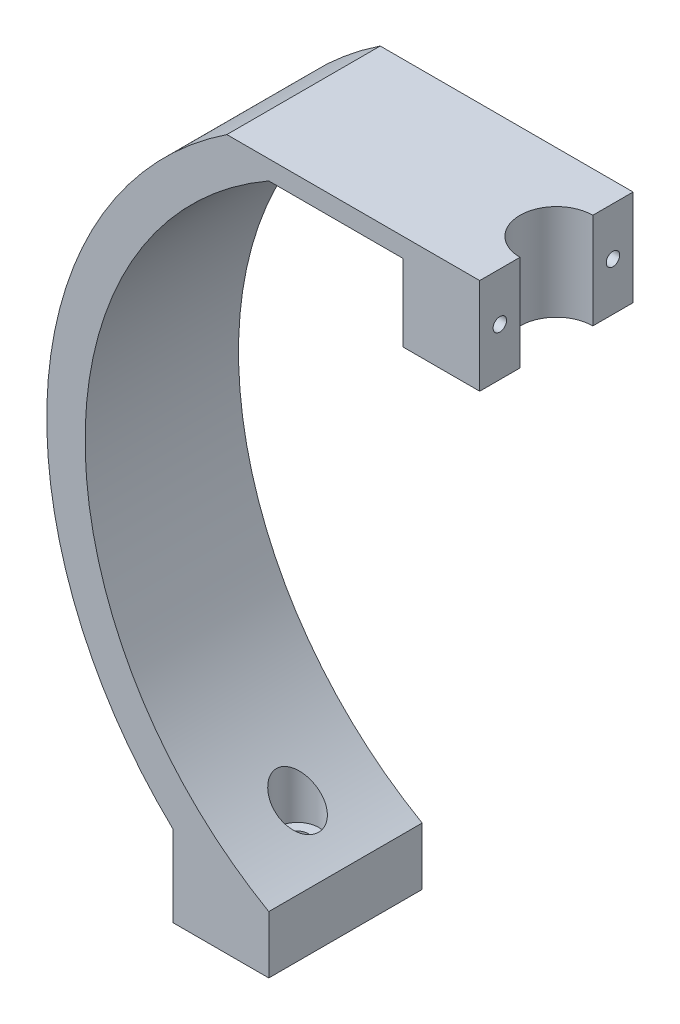
ISO-10303-21;
HEADER;
FILE_DESCRIPTION(('STEP AP214'),'2;1');
FILE_NAME('part.step','',(''),(''),'','','');
FILE_SCHEMA(('AUTOMOTIVE_DESIGN { 1 0 10303 214 1 1 1 1 }'));
ENDSEC;
DATA;
#1=APPLICATION_CONTEXT('core data for automotive mechanical design processes');
#2=APPLICATION_PROTOCOL_DEFINITION('international standard','automotive_design',2000,#1);
#3=PRODUCT_CONTEXT('',#1,'mechanical');
#4=PRODUCT('Part','Part','',(#3));
#5=PRODUCT_RELATED_PRODUCT_CATEGORY('part','',(#4));
#6=PRODUCT_DEFINITION_FORMATION('','',#4);
#7=PRODUCT_DEFINITION_CONTEXT('part definition',#1,'design');
#8=PRODUCT_DEFINITION('design','',#6,#7);
#9=PRODUCT_DEFINITION_SHAPE('','',#8);
#10=(LENGTH_UNIT() NAMED_UNIT(*) SI_UNIT(.MILLI.,.METRE.));
#11=(NAMED_UNIT(*) PLANE_ANGLE_UNIT() SI_UNIT($,.RADIAN.));
#12=(NAMED_UNIT(*) SI_UNIT($,.STERADIAN.) SOLID_ANGLE_UNIT());
#13=UNCERTAINTY_MEASURE_WITH_UNIT(LENGTH_MEASURE(1.E-05),#10,'distance_accuracy_value','');
#14=(GEOMETRIC_REPRESENTATION_CONTEXT(3) GLOBAL_UNCERTAINTY_ASSIGNED_CONTEXT((#13)) GLOBAL_UNIT_ASSIGNED_CONTEXT((#10,
#11,#12)) REPRESENTATION_CONTEXT('',''));
#15=CARTESIAN_POINT('',(0.,0.,0.));
#16=DIRECTION('',(0.,0.,1.));
#17=DIRECTION('',(1.,0.,0.));
#18=AXIS2_PLACEMENT_3D('',#15,#16,#17);
#19=CARTESIAN_POINT('',(54.9999999999999,0.,40.));
#20=DIRECTION('',(1.,0.,0.));
#21=DIRECTION('',(0.,1.,0.));
#22=AXIS2_PLACEMENT_3D('',#19,#20,#21);
#23=PLANE('',#22);
#24=CARTESIAN_POINT('',(55.,172.5,5.25));
#25=DIRECTION('',(1.,0.,0.));
#26=DIRECTION('',(0.,1.,0.));
#27=AXIS2_PLACEMENT_3D('',#24,#25,#26);
#28=CIRCLE('',#27,1.75);
#29=CARTESIAN_POINT('',(55.,174.25,5.25));
#30=VERTEX_POINT('',#29);
#31=EDGE_CURVE('E278',#30,#30,#28,.T.);
#32=ORIENTED_EDGE('',*,*,#31,.F.);
#33=EDGE_LOOP('',(#32));
#34=FACE_BOUND('',#33,.T.);
#35=DIRECTION('',(0.,1.,0.));
#36=VECTOR('',#35,1.);
#37=CARTESIAN_POINT('',(54.9999999999999,0.,10.5));
#38=LINE('',#37,#36);
#39=CARTESIAN_POINT('',(55.,160.,10.5));
#40=VERTEX_POINT('',#39);
#41=CARTESIAN_POINT('',(55.,185.,10.5));
#42=VERTEX_POINT('',#41);
#43=EDGE_CURVE('E52',#40,#42,#38,.T.);
#44=ORIENTED_EDGE('',*,*,#43,.F.);
#45=DIRECTION('',(0.,0.,-1.));
#46=VECTOR('',#45,1.);
#47=CARTESIAN_POINT('',(55.,160.,40.));
#48=LINE('',#47,#46);
#49=CARTESIAN_POINT('',(55.,160.,0.));
#50=VERTEX_POINT('',#49);
#51=EDGE_CURVE('E192',#40,#50,#48,.T.);
#52=ORIENTED_EDGE('',*,*,#51,.T.);
#53=DIRECTION('',(0.,-1.,0.));
#54=VECTOR('',#53,1.);
#55=CARTESIAN_POINT('',(54.9999999999999,0.,0.));
#56=LINE('',#55,#54);
#57=CARTESIAN_POINT('',(55.,185.,0.));
#58=VERTEX_POINT('',#57);
#59=EDGE_CURVE('E167',#58,#50,#56,.T.);
#60=ORIENTED_EDGE('',*,*,#59,.F.);
#61=DIRECTION('',(0.,0.,-1.));
#62=VECTOR('',#61,1.);
#63=CARTESIAN_POINT('',(55.,185.,40.));
#64=LINE('',#63,#62);
#65=EDGE_CURVE('E188',#42,#58,#64,.T.);
#66=ORIENTED_EDGE('',*,*,#65,.F.);
#67=EDGE_LOOP('',(#44,#52,#60,#66));
#68=FACE_BOUND('',#67,.T.);
#69=ADVANCED_FACE('F35',(#34,#68),#23,.T.);
#70=CARTESIAN_POINT('',(47.1036092035419,97.5,40.));
#71=DIRECTION('',(0.,0.,-1.));
#72=DIRECTION('',(-1.,0.,0.));
#73=AXIS2_PLACEMENT_3D('',#70,#71,#72);
#74=CYLINDRICAL_SURFACE('',#73,95.);
#75=CARTESIAN_POINT('',(-6.99999999999998,19.4115919540524,20.));
#76=CARTESIAN_POINT('',(-7.0000009869686,19.4115925639568,19.8661043937758));
#77=CARTESIAN_POINT('',(-7.00489824546729,19.4149850054462,19.732158764195));
#78=CARTESIAN_POINT('',(-7.02441978368931,19.4285159934316,19.4652597035589));
#79=CARTESIAN_POINT('',(-7.03905061222981,19.4386590818141,19.3323070014941));
#80=CARTESIAN_POINT('',(-7.07786201837415,19.4655926259034,19.0681901464949));
#81=CARTESIAN_POINT('',(-7.10206284054706,19.4823971735891,18.9370303989138));
#82=CARTESIAN_POINT('',(-7.15966475009984,19.5224498435519,18.6777011319279));
#83=CARTESIAN_POINT('',(-7.19306973229765,19.5457006936622,18.54953290337));
#84=CARTESIAN_POINT('',(-7.2684236644624,19.5982404732573,18.2977097252138));
#85=CARTESIAN_POINT('',(-7.31033029232306,19.6274995018536,18.1740358648949));
#86=CARTESIAN_POINT('',(-7.40223500243447,19.6917993231226,17.9312642486584));
#87=CARTESIAN_POINT('',(-7.45223617297003,19.7268423226354,17.8121682608672));
#88=CARTESIAN_POINT('',(-7.61340292392757,19.8400630531518,17.4629260189594));
#89=CARTESIAN_POINT('',(-7.73583819735879,19.9264063861757,17.240476657132));
#90=CARTESIAN_POINT('',(-8.01346795854365,20.1233990632073,16.8076412690641));
#91=CARTESIAN_POINT('',(-8.17018219894571,20.2351920476623,16.5987691008995));
#92=CARTESIAN_POINT('',(-8.50541200711585,20.4761114543053,16.2106628949097));
#93=CARTESIAN_POINT('',(-8.68393859200352,20.6052466390959,16.0314439430031));
#94=CARTESIAN_POINT('',(-9.08851607350995,20.9002770953979,15.676131595592));
#95=CARTESIAN_POINT('',(-9.31752922695893,21.0687122793748,15.5055342285848));
#96=CARTESIAN_POINT('',(-9.79064112243355,21.4202301829705,15.2054214982681));
#97=CARTESIAN_POINT('',(-10.0347496161457,21.6033223940959,15.0759330299227));
#98=CARTESIAN_POINT('',(-10.58120980503,22.0175459743272,14.8353087799247));
#99=CARTESIAN_POINT('',(-10.8855694349982,22.2510402782863,14.7327998288292));
#100=CARTESIAN_POINT('',(-11.4996165803356,22.7282570457488,14.5825032669629));
#101=CARTESIAN_POINT('',(-11.8093067534481,22.9719847040827,14.5347438058982));
#102=CARTESIAN_POINT('',(-12.4840145111374,23.5099115024857,14.4878345777059));
#103=CARTESIAN_POINT('',(-12.8488668135558,23.8052387399957,14.4990869123778));
#104=CARTESIAN_POINT('',(-13.5692993339244,24.3972251736281,14.5927141038347));
#105=CARTESIAN_POINT('',(-13.9248648118883,24.6938857036725,14.6751956941149));
#106=CARTESIAN_POINT('',(-14.4604661302952,25.1472071521153,14.8573777636252));
#107=CARTESIAN_POINT('',(-14.6470525424723,25.306411258662,14.9323526747125));
#108=CARTESIAN_POINT('',(-15.0133855106813,25.6213718396035,15.1036964445579));
#109=CARTESIAN_POINT('',(-15.1931303439392,25.7771274415558,15.2000706506547));
#110=CARTESIAN_POINT('',(-15.543679590514,26.0831164391344,15.4143546786435));
#111=CARTESIAN_POINT('',(-15.7144990967901,26.2333590202386,15.5322265241336));
#112=CARTESIAN_POINT('',(-16.0453856956619,26.526390306791,15.7899881821135));
#113=CARTESIAN_POINT('',(-16.2054596341978,26.6691837448684,15.9298637825002));
#114=CARTESIAN_POINT('',(-16.5513735152354,26.9797205482271,16.2704883614072));
#115=CARTESIAN_POINT('',(-16.7335009938535,27.1446489491992,16.4776876726956));
#116=CARTESIAN_POINT('',(-17.0705243295419,27.451927023366,16.9276828049992));
#117=CARTESIAN_POINT('',(-17.2254654625965,27.5943141971666,17.1704181833196));
#118=CARTESIAN_POINT('',(-17.4737836510737,27.8237247895339,17.6403813482405));
#119=CARTESIAN_POINT('',(-17.5732681635064,27.9161287002642,17.8616780184766));
#120=CARTESIAN_POINT('',(-17.7013263075806,28.0354497601163,18.2079603586708));
#121=CARTESIAN_POINT('',(-17.7404926383267,28.0720172130863,18.3258140649618));
#122=CARTESIAN_POINT('',(-17.8111583102984,28.1380846547648,18.5657036237994));
#123=CARTESIAN_POINT('',(-17.8426610974157,28.1675878198173,18.6877375684483));
#124=CARTESIAN_POINT('',(-17.8976491546935,28.2191379402155,18.936186529156));
#125=CARTESIAN_POINT('',(-17.9210702795059,28.2411252286256,19.0626282032071));
#126=CARTESIAN_POINT('',(-17.9590778383939,28.2768287488003,19.3179963206977));
#127=CARTESIAN_POINT('',(-17.9736642524205,28.2905449617951,19.4469227697753));
#128=CARTESIAN_POINT('',(-17.9936757016782,28.3093670488196,19.7060504686111));
#129=CARTESIAN_POINT('',(-17.9991051252456,28.3144770472338,19.8362510776415));
#130=CARTESIAN_POINT('',(-18.0006908436076,28.3159691943053,20.0967515757099));
#131=CARTESIAN_POINT('',(-17.9968480672732,28.3123522172142,20.2270514534961));
#132=CARTESIAN_POINT('',(-17.9810013523608,28.2974453876321,20.4708497195474));
#133=CARTESIAN_POINT('',(-17.970038012533,28.2871339342123,20.5844784793418));
#134=CARTESIAN_POINT('',(-17.9412004649268,28.2600322992255,20.8101092337272));
#135=CARTESIAN_POINT('',(-17.9233240170623,28.2432400176495,20.9221106887968));
#136=CARTESIAN_POINT('',(-17.8809541922434,28.2034823318698,21.1436996561278));
#137=CARTESIAN_POINT('',(-17.8564629091783,28.1805188811269,21.2532879204192));
#138=CARTESIAN_POINT('',(-17.8012307543655,28.1288015009172,21.4694984816323));
#139=CARTESIAN_POINT('',(-17.7704873957558,28.1000452673225,21.576119579071));
#140=CARTESIAN_POINT('',(-17.6673108952907,28.0036911367737,21.8974935091718));
#141=CARTESIAN_POINT('',(-17.5853088271145,27.9273059942619,22.1066704248831));
#142=CARTESIAN_POINT('',(-17.4003623045053,27.7557987895182,22.507045242345));
#143=CARTESIAN_POINT('',(-17.297406316343,27.6606664091068,22.6982331572368));
#144=CARTESIAN_POINT('',(-17.017298391155,27.4032020581593,23.1539402474283));
#145=CARTESIAN_POINT('',(-16.8290315908756,27.2312901496399,23.406343394176));
#146=CARTESIAN_POINT('',(-16.5249539687772,26.9562198332169,23.7514561186801));
#147=CARTESIAN_POINT('',(-16.4198018510832,26.8615023215119,23.8610555473824));
#148=CARTESIAN_POINT('',(-16.2031912057988,26.6673081733211,24.0692645504891));
#149=CARTESIAN_POINT('',(-16.0917326574877,26.5678315211986,24.1678740887813));
#150=CARTESIAN_POINT('',(-15.6809055534556,26.2030087733637,24.503161055747));
#151=CARTESIAN_POINT('',(-15.3655914430689,25.9263685755025,24.7089626058429));
#152=CARTESIAN_POINT('',(-14.8746837045087,25.5018142662215,24.9643711011671));
#153=CARTESIAN_POINT('',(-14.7079510712657,25.358606786406,25.0406552285633));
#154=CARTESIAN_POINT('',(-14.3694107641434,25.0699151328568,25.1757590381353));
#155=CARTESIAN_POINT('',(-14.197603476108,24.9244311326083,25.2345800443544));
#156=CARTESIAN_POINT('',(-13.671705141991,24.4823851805542,25.3862282135714));
#157=CARTESIAN_POINT('',(-13.3112501772653,24.1837931205835,25.4521271849916));
#158=CARTESIAN_POINT('',(-12.5820463950378,23.5889461510864,25.5115410506937));
#159=CARTESIAN_POINT('',(-12.2132925639617,23.2926928088039,25.5050109496732));
#160=CARTESIAN_POINT('',(-11.6455423358251,22.8434357265027,25.4369466189779));
#161=CARTESIAN_POINT('',(-11.4459649417974,22.6868271499271,25.4019073508562));
#162=CARTESIAN_POINT('',(-11.0488015158362,22.3776976329612,25.3090125394443));
#163=CARTESIAN_POINT('',(-10.8512158627527,22.2251774614042,25.251152736407));
#164=CARTESIAN_POINT('',(-10.4604322133407,21.9259197034283,25.112054307224));
#165=CARTESIAN_POINT('',(-10.2672275577764,21.7791730509846,25.0308541458596));
#166=CARTESIAN_POINT('',(-9.88726360371723,21.4927827892526,24.844420234889));
#167=CARTESIAN_POINT('',(-9.70050394499289,21.3531387827693,24.7391878310271));
#168=CARTESIAN_POINT('',(-9.27096132068488,21.0343061636938,24.4620476151671));
#169=CARTESIAN_POINT('',(-9.03199115649272,20.8588060109023,24.2797496293947));
#170=CARTESIAN_POINT('',(-8.57976361725899,20.5296148789333,23.8697186249007));
#171=CARTESIAN_POINT('',(-8.36646668135895,20.3758902785986,23.642056984606));
#172=CARTESIAN_POINT('',(-8.00575740040109,20.1178372420077,23.1817219746329));
#173=CARTESIAN_POINT('',(-7.85325750924021,20.0095450543684,22.9553209568065));
#174=CARTESIAN_POINT('',(-7.64866339365649,19.8649843106909,22.5949391084685));
#175=CARTESIAN_POINT('',(-7.58445740468172,19.8197533823549,22.4712611708247));
#176=CARTESIAN_POINT('',(-7.46491283624658,19.7357297088742,22.2175518345501));
#177=CARTESIAN_POINT('',(-7.40957400777057,19.6969367829306,22.0875206144718));
#178=CARTESIAN_POINT('',(-7.30822251248592,19.6260221243261,21.8209692128538));
#179=CARTESIAN_POINT('',(-7.26227980111272,19.5939503912209,21.6844090797505));
#180=CARTESIAN_POINT('',(-7.18095951231936,19.5372649303267,21.406675488611));
#181=CARTESIAN_POINT('',(-7.14558063706844,19.512650286384,21.2655025996459));
#182=CARTESIAN_POINT('',(-7.08607249061643,19.4712891933611,20.9800943749054));
#183=CARTESIAN_POINT('',(-7.06191229830242,19.454521116445,20.835868616155));
#184=CARTESIAN_POINT('',(-7.02514618534394,19.4290172508502,20.5453292337269));
#185=CARTESIAN_POINT('',(-7.01253073583318,19.420274837884,20.3990174333349));
#186=CARTESIAN_POINT('',(-7.00386260578095,19.4142682989034,20.2103517993504));
#187=CARTESIAN_POINT('',(-7.00241459925286,19.4132649588572,20.1683020123112));
#188=CARTESIAN_POINT('',(-7.0004831467304,19.411926694377,20.0841697974192));
#189=CARTESIAN_POINT('',(-6.9999996897664,19.4115917623413,20.0420873699429));
#190=CARTESIAN_POINT('',(-6.99999999999998,19.4115919540524,20.));
#191=B_SPLINE_CURVE_WITH_KNOTS('',3,(#75,#76,#77,#78,#79,#80,#81,#82,#83,#84,#85,#86,#87,#88,
#89,#90,#91,#92,#93,#94,#95,#96,#97,#98,#99,#100,#101,#102,#103,#104,#105,#106,#107,#108,#109,
#110,#111,#112,#113,#114,#115,#116,#117,#118,#119,#120,#121,#122,#123,#124,#125,#126,#127,#128,
#129,#130,#131,#132,#133,#134,#135,#136,#137,#138,#139,#140,#141,#142,#143,#144,#145,#146,#147,
#148,#149,#150,#151,#152,#153,#154,#155,#156,#157,#158,#159,#160,#161,#162,#163,#164,#165,#166,
#167,#168,#169,#170,#171,#172,#173,#174,#175,#176,#177,#178,#179,#180,#181,#182,#183,#184,#185,
#186,#187,#188,#189,#190),.UNSPECIFIED.,.T.,.F.,(4,2,2,2,2,2,2,2,2,2,2,2,2,2,2,2,2,2,2,2,2,2,2,
2,2,2,2,2,2,2,2,2,2,2,2,2,2,2,2,2,2,2,2,2,2,2,2,2,2,2,2,2,2,2,2,2,2,4),(0.,0.401641838696404,
0.803554178617075,1.2063213201928,1.60925915852745,2.01023829140946,2.41137077068445,
3.21253232905326,4.06154080749802,4.91097989525166,5.90194889521136,6.89356489408235,
8.08032952478209,9.2677040627754,10.6706975919729,12.0757970922355,12.844394972873,
13.6131851302984,14.3806301183585,15.1475814379458,16.1083642388905,17.067531448627,
17.8430284441814,18.2310047958018,18.6188063711018,19.0096187634343,19.4004320426506,
19.7910579777825,20.1816447823813,20.5251065390858,20.8686796826585,21.2121441972639,
21.5557455984705,22.2647152974355,22.9740762972969,24.0439662144913,24.580578344283,
25.1171922373006,26.5104011297202,27.207857793225,27.9052615624717,29.3173888512825,
30.7303934487368,31.4977877430092,32.26532534917,33.0316052393025,33.797842230232,
34.837732716886,35.8759997054825,36.7529790506602,37.192040570683,37.6310897584198,
38.0732974244956,38.5154507403273,38.9563780447068,39.3969410848577,39.5231904919602,
39.6494384632452),.UNSPECIFIED.);
#192=CARTESIAN_POINT('',(-6.99999999999998,19.4115919540524,20.));
#193=VERTEX_POINT('',#192);
#194=EDGE_CURVE('E203',#193,#193,#191,.T.);
#195=ORIENTED_EDGE('',*,*,#194,.F.);
#196=EDGE_LOOP('',(#195));
#197=FACE_BOUND('',#196,.T.);
#198=CARTESIAN_POINT('',(47.1036092035419,97.5,0.));
#199=DIRECTION('',(0.,0.,1.));
#200=DIRECTION('',(1.,0.,0.));
#201=AXIS2_PLACEMENT_3D('',#198,#199,#200);
#202=CIRCLE('',#201,95.);
#203=CARTESIAN_POINT('',(0.,180.,0.));
#204=VERTEX_POINT('',#203);
#205=CARTESIAN_POINT('',(0.,15.,0.));
#206=VERTEX_POINT('',#205);
#207=EDGE_CURVE('E156',#204,#206,#202,.T.);
#208=ORIENTED_EDGE('',*,*,#207,.F.);
#209=DIRECTION('',(0.,0.,-1.));
#210=VECTOR('',#209,1.);
#211=CARTESIAN_POINT('',(0.,180.,40.));
#212=LINE('',#211,#210);
#213=CARTESIAN_POINT('',(0.,180.,40.));
#214=VERTEX_POINT('',#213);
#215=EDGE_CURVE('E45',#214,#204,#212,.T.);
#216=ORIENTED_EDGE('',*,*,#215,.F.);
#217=CARTESIAN_POINT('',(47.1036092035419,97.5,40.));
#218=DIRECTION('',(0.,0.,1.));
#219=DIRECTION('',(1.,0.,0.));
#220=AXIS2_PLACEMENT_3D('',#217,#218,#219);
#221=CIRCLE('',#220,95.);
#222=CARTESIAN_POINT('',(0.,15.,40.));
#223=VERTEX_POINT('',#222);
#224=EDGE_CURVE('E182',#214,#223,#221,.T.);
#225=ORIENTED_EDGE('',*,*,#224,.T.);
#226=DIRECTION('',(0.,0.,-1.));
#227=VECTOR('',#226,1.);
#228=CARTESIAN_POINT('',(0.,15.,40.));
#229=LINE('',#228,#227);
#230=EDGE_CURVE('E61',#223,#206,#229,.T.);
#231=ORIENTED_EDGE('',*,*,#230,.T.);
#232=EDGE_LOOP('',(#208,#216,#225,#231));
#233=FACE_BOUND('',#232,.T.);
#234=ADVANCED_FACE('F37',(#197,#233),#74,.F.);
#235=CARTESIAN_POINT('',(0.,180.,40.));
#236=DIRECTION('',(0.,-1.,0.));
#237=DIRECTION('',(0.,0.,-1.));
#238=AXIS2_PLACEMENT_3D('',#235,#236,#237);
#239=PLANE('',#238);
#240=DIRECTION('',(-1.,0.,0.));
#241=VECTOR('',#240,1.);
#242=CARTESIAN_POINT('',(0.,180.,0.));
#243=LINE('',#242,#241);
#244=CARTESIAN_POINT('',(35.,180.,0.));
#245=VERTEX_POINT('',#244);
#246=EDGE_CURVE('E158',#245,#204,#243,.T.);
#247=ORIENTED_EDGE('',*,*,#246,.F.);
#248=DIRECTION('',(0.,0.,-1.));
#249=VECTOR('',#248,1.);
#250=CARTESIAN_POINT('',(35.,180.,40.));
#251=LINE('',#250,#249);
#252=CARTESIAN_POINT('',(35.,180.,40.));
#253=VERTEX_POINT('',#252);
#254=EDGE_CURVE('E198',#253,#245,#251,.T.);
#255=ORIENTED_EDGE('',*,*,#254,.F.);
#256=DIRECTION('',(-1.,0.,0.));
#257=VECTOR('',#256,1.);
#258=CARTESIAN_POINT('',(0.,180.,40.));
#259=LINE('',#258,#257);
#260=EDGE_CURVE('E307',#253,#214,#259,.T.);
#261=ORIENTED_EDGE('',*,*,#260,.T.);
#262=ORIENTED_EDGE('',*,*,#215,.T.);
#263=EDGE_LOOP('',(#247,#255,#261,#262));
#264=FACE_BOUND('',#263,.T.);
#265=ADVANCED_FACE('F259',(#264),#239,.T.);
#266=CARTESIAN_POINT('',(35.,0.,40.));
#267=DIRECTION('',(-1.,0.,0.));
#268=DIRECTION('',(0.,0.,1.));
#269=AXIS2_PLACEMENT_3D('',#266,#267,#268);
#270=PLANE('',#269);
#271=CARTESIAN_POINT('',(35.,172.5,5.25));
#272=DIRECTION('',(-1.,0.,0.));
#273=DIRECTION('',(0.,0.,1.));
#274=AXIS2_PLACEMENT_3D('',#271,#272,#273);
#275=CIRCLE('',#274,1.75);
#276=CARTESIAN_POINT('',(35.,172.5,7.));
#277=VERTEX_POINT('',#276);
#278=EDGE_CURVE('E40',#277,#277,#275,.T.);
#279=ORIENTED_EDGE('',*,*,#278,.F.);
#280=EDGE_LOOP('',(#279));
#281=FACE_BOUND('',#280,.T.);
#282=CARTESIAN_POINT('',(35.,172.5,34.75));
#283=DIRECTION('',(-1.,0.,0.));
#284=DIRECTION('',(0.,0.,1.));
#285=AXIS2_PLACEMENT_3D('',#282,#283,#284);
#286=CIRCLE('',#285,1.75);
#287=CARTESIAN_POINT('',(35.,172.5,36.5));
#288=VERTEX_POINT('',#287);
#289=EDGE_CURVE('E324',#288,#288,#286,.T.);
#290=ORIENTED_EDGE('',*,*,#289,.F.);
#291=EDGE_LOOP('',(#290));
#292=FACE_BOUND('',#291,.T.);
#293=DIRECTION('',(0.,1.,0.));
#294=VECTOR('',#293,1.);
#295=CARTESIAN_POINT('',(35.,0.,0.));
#296=LINE('',#295,#294);
#297=CARTESIAN_POINT('',(35.,160.,0.));
#298=VERTEX_POINT('',#297);
#299=EDGE_CURVE('E161',#298,#245,#296,.T.);
#300=ORIENTED_EDGE('',*,*,#299,.F.);
#301=DIRECTION('',(0.,0.,-1.));
#302=VECTOR('',#301,1.);
#303=CARTESIAN_POINT('',(35.,160.,40.));
#304=LINE('',#303,#302);
#305=CARTESIAN_POINT('',(35.,160.,40.));
#306=VERTEX_POINT('',#305);
#307=EDGE_CURVE('E196',#306,#298,#304,.T.);
#308=ORIENTED_EDGE('',*,*,#307,.F.);
#309=DIRECTION('',(0.,1.,0.));
#310=VECTOR('',#309,1.);
#311=CARTESIAN_POINT('',(35.,0.,40.));
#312=LINE('',#311,#310);
#313=EDGE_CURVE('E310',#306,#253,#312,.T.);
#314=ORIENTED_EDGE('',*,*,#313,.T.);
#315=ORIENTED_EDGE('',*,*,#254,.T.);
#316=EDGE_LOOP('',(#300,#308,#314,#315));
#317=FACE_BOUND('',#316,.T.);
#318=ADVANCED_FACE('F256',(#281,#292,#317),#270,.T.);
#319=CARTESIAN_POINT('',(0.,160.,40.));
#320=DIRECTION('',(0.,-1.,0.));
#321=DIRECTION('',(0.,0.,-1.));
#322=AXIS2_PLACEMENT_3D('',#319,#320,#321);
#323=PLANE('',#322);
#324=CARTESIAN_POINT('',(55.,160.,20.));
#325=DIRECTION('',(0.,-1.,0.));
#326=DIRECTION('',(0.,0.,-1.));
#327=AXIS2_PLACEMENT_3D('',#324,#325,#326);
#328=CIRCLE('',#327,9.49999999999999);
#329=CARTESIAN_POINT('',(54.9999999999999,160.,29.5));
#330=VERTEX_POINT('',#329);
#331=EDGE_CURVE('E284',#330,#40,#328,.T.);
#332=ORIENTED_EDGE('',*,*,#331,.F.);
#333=CARTESIAN_POINT('',(55.,160.,40.));
#334=VERTEX_POINT('',#333);
#335=EDGE_CURVE('E193',#334,#330,#48,.T.);
#336=ORIENTED_EDGE('',*,*,#335,.F.);
#337=DIRECTION('',(-1.,0.,0.));
#338=VECTOR('',#337,1.);
#339=CARTESIAN_POINT('',(0.,160.,40.));
#340=LINE('',#339,#338);
#341=EDGE_CURVE('E313',#334,#306,#340,.T.);
#342=ORIENTED_EDGE('',*,*,#341,.T.);
#343=ORIENTED_EDGE('',*,*,#307,.T.);
#344=DIRECTION('',(-1.,0.,0.));
#345=VECTOR('',#344,1.);
#346=CARTESIAN_POINT('',(0.,160.,0.));
#347=LINE('',#346,#345);
#348=EDGE_CURVE('E164',#50,#298,#347,.T.);
#349=ORIENTED_EDGE('',*,*,#348,.F.);
#350=ORIENTED_EDGE('',*,*,#51,.F.);
#351=EDGE_LOOP('',(#332,#336,#342,#343,#349,#350));
#352=FACE_BOUND('',#351,.T.);
#353=ADVANCED_FACE('F252',(#352),#323,.T.);
#354=CARTESIAN_POINT('',(55.,172.5,34.75));
#355=DIRECTION('',(1.,0.,0.));
#356=DIRECTION('',(0.,1.,0.));
#357=AXIS2_PLACEMENT_3D('',#354,#355,#356);
#358=CIRCLE('',#357,1.75);
#359=CARTESIAN_POINT('',(55.,174.25,34.75));
#360=VERTEX_POINT('',#359);
#361=EDGE_CURVE('E327',#360,#360,#358,.T.);
#362=ORIENTED_EDGE('',*,*,#361,.F.);
#363=EDGE_LOOP('',(#362));
#364=FACE_BOUND('',#363,.T.);
#365=DIRECTION('',(0.,1.,0.));
#366=VECTOR('',#365,1.);
#367=CARTESIAN_POINT('',(54.9999999999999,0.,29.5));
#368=LINE('',#367,#366);
#369=CARTESIAN_POINT('',(55.,185.,29.5));
#370=VERTEX_POINT('',#369);
#371=EDGE_CURVE('E295',#370,#330,#368,.F.);
#372=ORIENTED_EDGE('',*,*,#371,.F.);
#373=CARTESIAN_POINT('',(55.,185.,40.));
#374=VERTEX_POINT('',#373);
#375=EDGE_CURVE('E189',#374,#370,#64,.T.);
#376=ORIENTED_EDGE('',*,*,#375,.F.);
#377=DIRECTION('',(0.,-1.,0.));
#378=VECTOR('',#377,1.);
#379=CARTESIAN_POINT('',(54.9999999999999,0.,40.));
#380=LINE('',#379,#378);
#381=EDGE_CURVE('E315',#374,#334,#380,.T.);
#382=ORIENTED_EDGE('',*,*,#381,.T.);
#383=ORIENTED_EDGE('',*,*,#335,.T.);
#384=EDGE_LOOP('',(#372,#376,#382,#383));
#385=FACE_BOUND('',#384,.T.);
#386=ADVANCED_FACE('F248',(#364,#385),#23,.T.);
#387=CARTESIAN_POINT('',(0.,185.,40.));
#388=DIRECTION('',(0.,1.,0.));
#389=DIRECTION('',(0.,0.,1.));
#390=AXIS2_PLACEMENT_3D('',#387,#388,#389);
#391=PLANE('',#390);
#392=CARTESIAN_POINT('',(55.,185.,20.));
#393=DIRECTION('',(0.,1.,0.));
#394=DIRECTION('',(0.,0.,1.));
#395=AXIS2_PLACEMENT_3D('',#392,#393,#394);
#396=CIRCLE('',#395,9.49999999999999);
#397=EDGE_CURVE('E11',#42,#370,#396,.T.);
#398=ORIENTED_EDGE('',*,*,#397,.F.);
#399=ORIENTED_EDGE('',*,*,#65,.T.);
#400=DIRECTION('',(1.,0.,0.));
#401=VECTOR('',#400,1.);
#402=CARTESIAN_POINT('',(0.,185.,0.));
#403=LINE('',#402,#401);
#404=CARTESIAN_POINT('',(-10.9373246276776,185.,0.));
#405=VERTEX_POINT('',#404);
#406=EDGE_CURVE('E170',#405,#58,#403,.T.);
#407=ORIENTED_EDGE('',*,*,#406,.F.);
#408=DIRECTION('',(0.,0.,-1.));
#409=VECTOR('',#408,1.);
#410=CARTESIAN_POINT('',(-10.9373246276776,185.,40.));
#411=LINE('',#410,#409);
#412=CARTESIAN_POINT('',(-10.9373246276776,185.,40.));
#413=VERTEX_POINT('',#412);
#414=EDGE_CURVE('E186',#413,#405,#411,.T.);
#415=ORIENTED_EDGE('',*,*,#414,.F.);
#416=DIRECTION('',(1.,0.,0.));
#417=VECTOR('',#416,1.);
#418=CARTESIAN_POINT('',(0.,185.,40.));
#419=LINE('',#418,#417);
#420=EDGE_CURVE('E317',#413,#374,#419,.T.);
#421=ORIENTED_EDGE('',*,*,#420,.T.);
#422=ORIENTED_EDGE('',*,*,#375,.T.);
#423=EDGE_LOOP('',(#398,#399,#407,#415,#421,#422));
#424=FACE_BOUND('',#423,.T.);
#425=ADVANCED_FACE('F244',(#424),#391,.T.);
#426=CARTESIAN_POINT('',(47.1036092035419,97.5,40.));
#427=DIRECTION('',(0.,0.,-1.));
#428=DIRECTION('',(-1.,0.,0.));
#429=AXIS2_PLACEMENT_3D('',#426,#427,#428);
#430=CYLINDRICAL_SURFACE('',#429,105.);
#431=CARTESIAN_POINT('',(47.1036092035419,97.5,0.));
#432=DIRECTION('',(0.,0.,1.));
#433=DIRECTION('',(1.,0.,0.));
#434=AXIS2_PLACEMENT_3D('',#431,#432,#433);
#435=CIRCLE('',#434,105.);
#436=CARTESIAN_POINT('',(-25.,21.1713059208864,0.));
#437=VERTEX_POINT('',#436);
#438=EDGE_CURVE('E173',#405,#437,#435,.T.);
#439=ORIENTED_EDGE('',*,*,#438,.T.);
#440=DIRECTION('',(0.,0.,-1.));
#441=VECTOR('',#440,1.);
#442=CARTESIAN_POINT('',(-25.,21.1713059208864,40.));
#443=LINE('',#442,#441);
#444=CARTESIAN_POINT('',(-25.,21.1713059208864,40.));
#445=VERTEX_POINT('',#444);
#446=EDGE_CURVE('E137',#445,#437,#443,.T.);
#447=ORIENTED_EDGE('',*,*,#446,.F.);
#448=CARTESIAN_POINT('',(47.1036092035419,97.5,40.));
#449=DIRECTION('',(0.,0.,1.));
#450=DIRECTION('',(1.,0.,0.));
#451=AXIS2_PLACEMENT_3D('',#448,#449,#450);
#452=CIRCLE('',#451,105.);
#453=EDGE_CURVE('E147',#413,#445,#452,.T.);
#454=ORIENTED_EDGE('',*,*,#453,.F.);
#455=ORIENTED_EDGE('',*,*,#414,.T.);
#456=EDGE_LOOP('',(#439,#447,#454,#455));
#457=FACE_BOUND('',#456,.T.);
#458=ADVANCED_FACE('F241',(#457),#430,.T.);
#459=CARTESIAN_POINT('',(-25.,0.,40.));
#460=DIRECTION('',(-1.,0.,0.));
#461=DIRECTION('',(0.,-1.,0.));
#462=AXIS2_PLACEMENT_3D('',#459,#460,#461);
#463=PLANE('',#462);
#464=DIRECTION('',(0.,1.,0.));
#465=VECTOR('',#464,1.);
#466=CARTESIAN_POINT('',(-25.,0.,0.));
#467=LINE('',#466,#465);
#468=CARTESIAN_POINT('',(-25.,0.,0.));
#469=VERTEX_POINT('',#468);
#470=EDGE_CURVE('E132',#469,#437,#467,.T.);
#471=ORIENTED_EDGE('',*,*,#470,.F.);
#472=DIRECTION('',(0.,0.,-1.));
#473=VECTOR('',#472,1.);
#474=CARTESIAN_POINT('',(-25.,0.,40.));
#475=LINE('',#474,#473);
#476=CARTESIAN_POINT('',(-25.,0.,40.));
#477=VERTEX_POINT('',#476);
#478=EDGE_CURVE('E127',#477,#469,#475,.T.);
#479=ORIENTED_EDGE('',*,*,#478,.F.);
#480=DIRECTION('',(0.,1.,0.));
#481=VECTOR('',#480,1.);
#482=CARTESIAN_POINT('',(-25.,0.,40.));
#483=LINE('',#482,#481);
#484=EDGE_CURVE('E130',#477,#445,#483,.T.);
#485=ORIENTED_EDGE('',*,*,#484,.T.);
#486=ORIENTED_EDGE('',*,*,#446,.T.);
#487=EDGE_LOOP('',(#471,#479,#485,#486));
#488=FACE_BOUND('',#487,.T.);
#489=ADVANCED_FACE('F129',(#488),#463,.T.);
#490=CARTESIAN_POINT('',(0.,0.,40.));
#491=DIRECTION('',(0.,-1.,0.));
#492=DIRECTION('',(1.,0.,0.));
#493=AXIS2_PLACEMENT_3D('',#490,#491,#492);
#494=PLANE('',#493);
#495=CARTESIAN_POINT('',(-12.5,0.,20.));
#496=DIRECTION('',(0.,-1.,0.));
#497=DIRECTION('',(1.,0.,0.));
#498=AXIS2_PLACEMENT_3D('',#495,#496,#497);
#499=CIRCLE('',#498,2.75);
#500=CARTESIAN_POINT('',(-9.74999999999998,0.,20.));
#501=VERTEX_POINT('',#500);
#502=EDGE_CURVE('E210',#501,#501,#499,.T.);
#503=ORIENTED_EDGE('',*,*,#502,.F.);
#504=EDGE_LOOP('',(#503));
#505=FACE_BOUND('',#504,.T.);
#506=DIRECTION('',(-1.,0.,0.));
#507=VECTOR('',#506,1.);
#508=CARTESIAN_POINT('',(0.,0.,0.));
#509=LINE('',#508,#507);
#510=CARTESIAN_POINT('',(0.,0.,0.));
#511=VERTEX_POINT('',#510);
#512=EDGE_CURVE('E177',#511,#469,#509,.T.);
#513=ORIENTED_EDGE('',*,*,#512,.F.);
#514=DIRECTION('',(0.,0.,-1.));
#515=VECTOR('',#514,1.);
#516=CARTESIAN_POINT('',(0.,0.,40.));
#517=LINE('',#516,#515);
#518=CARTESIAN_POINT('',(0.,0.,40.));
#519=VERTEX_POINT('',#518);
#520=EDGE_CURVE('E138',#519,#511,#517,.T.);
#521=ORIENTED_EDGE('',*,*,#520,.F.);
#522=DIRECTION('',(-1.,0.,0.));
#523=VECTOR('',#522,1.);
#524=CARTESIAN_POINT('',(0.,0.,40.));
#525=LINE('',#524,#523);
#526=EDGE_CURVE('E144',#519,#477,#525,.T.);
#527=ORIENTED_EDGE('',*,*,#526,.T.);
#528=ORIENTED_EDGE('',*,*,#478,.T.);
#529=EDGE_LOOP('',(#513,#521,#527,#528));
#530=FACE_BOUND('',#529,.T.);
#531=ADVANCED_FACE('F150',(#505,#530),#494,.T.);
#532=CARTESIAN_POINT('',(0.,0.,40.));
#533=DIRECTION('',(1.,0.,0.));
#534=DIRECTION('',(0.,0.,-1.));
#535=AXIS2_PLACEMENT_3D('',#532,#533,#534);
#536=PLANE('',#535);
#537=DIRECTION('',(0.,-1.,0.));
#538=VECTOR('',#537,1.);
#539=CARTESIAN_POINT('',(0.,0.,0.));
#540=LINE('',#539,#538);
#541=EDGE_CURVE('E179',#206,#511,#540,.T.);
#542=ORIENTED_EDGE('',*,*,#541,.F.);
#543=ORIENTED_EDGE('',*,*,#230,.F.);
#544=DIRECTION('',(0.,-1.,0.));
#545=VECTOR('',#544,1.);
#546=CARTESIAN_POINT('',(0.,0.,40.));
#547=LINE('',#546,#545);
#548=EDGE_CURVE('E151',#223,#519,#547,.T.);
#549=ORIENTED_EDGE('',*,*,#548,.T.);
#550=ORIENTED_EDGE('',*,*,#520,.T.);
#551=EDGE_LOOP('',(#542,#543,#549,#550));
#552=FACE_BOUND('',#551,.T.);
#553=ADVANCED_FACE('F230',(#552),#536,.T.);
#554=CARTESIAN_POINT('',(0.,0.,40.));
#555=DIRECTION('',(0.,0.,1.));
#556=DIRECTION('',(1.,0.,0.));
#557=AXIS2_PLACEMENT_3D('',#554,#555,#556);
#558=PLANE('',#557);
#559=ORIENTED_EDGE('',*,*,#224,.F.);
#560=ORIENTED_EDGE('',*,*,#260,.F.);
#561=ORIENTED_EDGE('',*,*,#313,.F.);
#562=ORIENTED_EDGE('',*,*,#341,.F.);
#563=ORIENTED_EDGE('',*,*,#381,.F.);
#564=ORIENTED_EDGE('',*,*,#420,.F.);
#565=ORIENTED_EDGE('',*,*,#453,.T.);
#566=ORIENTED_EDGE('',*,*,#484,.F.);
#567=ORIENTED_EDGE('',*,*,#526,.F.);
#568=ORIENTED_EDGE('',*,*,#548,.F.);
#569=EDGE_LOOP('',(#559,#560,#561,#562,#563,#564,#565,#566,#567,#568));
#570=FACE_BOUND('',#569,.T.);
#571=ADVANCED_FACE('F142',(#570),#558,.T.);
#572=CARTESIAN_POINT('',(0.,0.,0.));
#573=DIRECTION('',(0.,0.,1.));
#574=DIRECTION('',(1.,0.,0.));
#575=AXIS2_PLACEMENT_3D('',#572,#573,#574);
#576=PLANE('',#575);
#577=ORIENTED_EDGE('',*,*,#207,.T.);
#578=ORIENTED_EDGE('',*,*,#541,.T.);
#579=ORIENTED_EDGE('',*,*,#512,.T.);
#580=ORIENTED_EDGE('',*,*,#470,.T.);
#581=ORIENTED_EDGE('',*,*,#438,.F.);
#582=ORIENTED_EDGE('',*,*,#406,.T.);
#583=ORIENTED_EDGE('',*,*,#59,.T.);
#584=ORIENTED_EDGE('',*,*,#348,.T.);
#585=ORIENTED_EDGE('',*,*,#299,.T.);
#586=ORIENTED_EDGE('',*,*,#246,.T.);
#587=EDGE_LOOP('',(#577,#578,#579,#580,#581,#582,#583,#584,#585,#586));
#588=FACE_BOUND('',#587,.T.);
#589=ADVANCED_FACE('F227',(#588),#576,.F.);
#590=CARTESIAN_POINT('',(55.,0.,20.));
#591=DIRECTION('',(0.,1.,0.));
#592=DIRECTION('',(0.,0.,1.));
#593=AXIS2_PLACEMENT_3D('',#590,#591,#592);
#594=CYLINDRICAL_SURFACE('',#593,9.49999999999999);
#595=ORIENTED_EDGE('',*,*,#43,.T.);
#596=ORIENTED_EDGE('',*,*,#397,.T.);
#597=ORIENTED_EDGE('',*,*,#371,.T.);
#598=ORIENTED_EDGE('',*,*,#331,.T.);
#599=EDGE_LOOP('',(#595,#596,#597,#598));
#600=FACE_BOUND('',#599,.T.);
#601=ADVANCED_FACE('F223',(#600),#594,.F.);
#602=CARTESIAN_POINT('',(-12.5,40.,20.));
#603=DIRECTION('',(0.,-1.,0.));
#604=DIRECTION('',(1.,0.,0.));
#605=AXIS2_PLACEMENT_3D('',#602,#603,#604);
#606=CYLINDRICAL_SURFACE('',#605,2.75);
#607=CARTESIAN_POINT('',(-12.5,15.,20.));
#608=DIRECTION('',(0.,-1.,0.));
#609=DIRECTION('',(1.,0.,0.));
#610=AXIS2_PLACEMENT_3D('',#607,#608,#609);
#611=CIRCLE('',#610,2.75);
#612=CARTESIAN_POINT('',(-9.74999999999998,15.,20.));
#613=VERTEX_POINT('',#612);
#614=EDGE_CURVE('E201',#613,#613,#611,.F.);
#615=ORIENTED_EDGE('',*,*,#614,.T.);
#616=EDGE_LOOP('',(#615));
#617=FACE_BOUND('',#616,.T.);
#618=ORIENTED_EDGE('',*,*,#502,.T.);
#619=EDGE_LOOP('',(#618));
#620=FACE_BOUND('',#619,.T.);
#621=ADVANCED_FACE('F220',(#617,#620),#606,.F.);
#622=CARTESIAN_POINT('',(-12.5,15.,20.));
#623=DIRECTION('',(0.,-1.,0.));
#624=DIRECTION('',(1.,0.,0.));
#625=AXIS2_PLACEMENT_3D('',#622,#623,#624);
#626=PLANE('',#625);
#627=CARTESIAN_POINT('',(-12.5,15.,20.));
#628=DIRECTION('',(0.,-1.,0.));
#629=DIRECTION('',(1.,0.,0.));
#630=AXIS2_PLACEMENT_3D('',#627,#628,#629);
#631=CIRCLE('',#630,5.5);
#632=CARTESIAN_POINT('',(-6.99999999999998,15.,20.));
#633=VERTEX_POINT('',#632);
#634=EDGE_CURVE('E204',#633,#633,#631,.T.);
#635=ORIENTED_EDGE('',*,*,#634,.F.);
#636=EDGE_LOOP('',(#635));
#637=FACE_BOUND('',#636,.T.);
#638=ORIENTED_EDGE('',*,*,#614,.F.);
#639=EDGE_LOOP('',(#638));
#640=FACE_BOUND('',#639,.T.);
#641=ADVANCED_FACE('F217',(#637,#640),#626,.F.);
#642=CARTESIAN_POINT('',(-12.5,44.,20.));
#643=DIRECTION('',(0.,-1.,0.));
#644=DIRECTION('',(1.,0.,0.));
#645=AXIS2_PLACEMENT_3D('',#642,#643,#644);
#646=CYLINDRICAL_SURFACE('',#645,5.5);
#647=ORIENTED_EDGE('',*,*,#194,.T.);
#648=EDGE_LOOP('',(#647));
#649=FACE_BOUND('',#648,.T.);
#650=ORIENTED_EDGE('',*,*,#634,.T.);
#651=EDGE_LOOP('',(#650));
#652=FACE_BOUND('',#651,.T.);
#653=ADVANCED_FACE('F211',(#649,#652),#646,.F.);
#654=CARTESIAN_POINT('',(24.,172.5,34.75));
#655=DIRECTION('',(1.,0.,0.));
#656=DIRECTION('',(0.,1.,0.));
#657=AXIS2_PLACEMENT_3D('',#654,#655,#656);
#658=CYLINDRICAL_SURFACE('',#657,1.75);
#659=ORIENTED_EDGE('',*,*,#289,.T.);
#660=EDGE_LOOP('',(#659));
#661=FACE_BOUND('',#660,.T.);
#662=ORIENTED_EDGE('',*,*,#361,.T.);
#663=EDGE_LOOP('',(#662));
#664=FACE_BOUND('',#663,.T.);
#665=ADVANCED_FACE('F216',(#661,#664),#658,.F.);
#666=CARTESIAN_POINT('',(24.,172.5,5.25));
#667=DIRECTION('',(1.,0.,0.));
#668=DIRECTION('',(0.,1.,0.));
#669=AXIS2_PLACEMENT_3D('',#666,#667,#668);
#670=CYLINDRICAL_SURFACE('',#669,1.75);
#671=ORIENTED_EDGE('',*,*,#278,.T.);
#672=EDGE_LOOP('',(#671));
#673=FACE_BOUND('',#672,.T.);
#674=ORIENTED_EDGE('',*,*,#31,.T.);
#675=EDGE_LOOP('',(#674));
#676=FACE_BOUND('',#675,.T.);
#677=ADVANCED_FACE('F331',(#673,#676),#670,.F.);
#678=CLOSED_SHELL('',(#69,#234,#265,#318,#353,#386,#425,#458,#489,#531,#553,#571,#589,#601,#621,
#641,#653,#665,#677));
#679=MANIFOLD_SOLID_BREP('B2',#678);
#680=ADVANCED_BREP_SHAPE_REPRESENTATION('',(#18,#679),#14);
#681=SHAPE_DEFINITION_REPRESENTATION(#9,#680);
ENDSEC;
END-ISO-10303-21;
